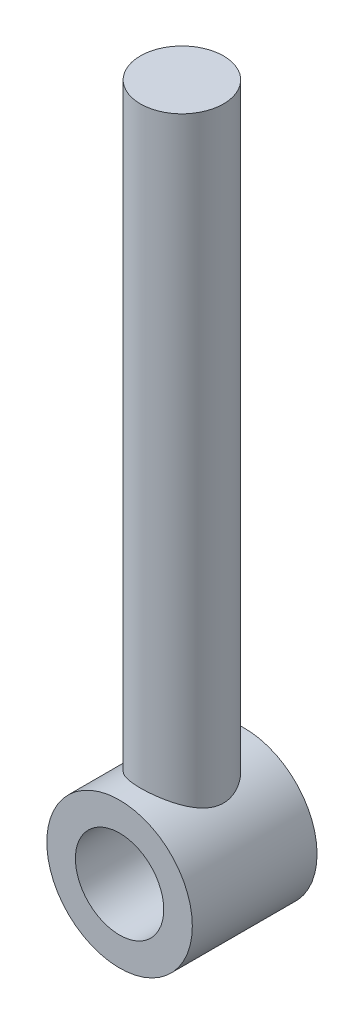
ISO-10303-21;
HEADER;
FILE_DESCRIPTION(('STEP AP214'),'2;1');
FILE_NAME('part.step','',(''),(''),'','','');
FILE_SCHEMA(('AUTOMOTIVE_DESIGN { 1 0 10303 214 1 1 1 1 }'));
ENDSEC;
DATA;
#1=APPLICATION_CONTEXT('core data for automotive mechanical design processes');
#2=APPLICATION_PROTOCOL_DEFINITION('international standard','automotive_design',2000,#1);
#3=PRODUCT_CONTEXT('',#1,'mechanical');
#4=PRODUCT('Part','Part','',(#3));
#5=PRODUCT_RELATED_PRODUCT_CATEGORY('part','',(#4));
#6=PRODUCT_DEFINITION_FORMATION('','',#4);
#7=PRODUCT_DEFINITION_CONTEXT('part definition',#1,'design');
#8=PRODUCT_DEFINITION('design','',#6,#7);
#9=PRODUCT_DEFINITION_SHAPE('','',#8);
#10=(LENGTH_UNIT() NAMED_UNIT(*) SI_UNIT(.MILLI.,.METRE.));
#11=(NAMED_UNIT(*) PLANE_ANGLE_UNIT() SI_UNIT($,.RADIAN.));
#12=(NAMED_UNIT(*) SI_UNIT($,.STERADIAN.) SOLID_ANGLE_UNIT());
#13=UNCERTAINTY_MEASURE_WITH_UNIT(LENGTH_MEASURE(1.E-05),#10,'distance_accuracy_value','');
#14=(GEOMETRIC_REPRESENTATION_CONTEXT(3) GLOBAL_UNCERTAINTY_ASSIGNED_CONTEXT((#13)) GLOBAL_UNIT_ASSIGNED_CONTEXT((#10,
#11,#12)) REPRESENTATION_CONTEXT('',''));
#15=CARTESIAN_POINT('',(0.,0.,0.));
#16=DIRECTION('',(0.,0.,1.));
#17=DIRECTION('',(1.,0.,0.));
#18=AXIS2_PLACEMENT_3D('',#15,#16,#17);
#19=CARTESIAN_POINT('',(0.,0.,-9.525));
#20=DIRECTION('',(0.,0.,1.));
#21=DIRECTION('',(1.,0.,0.));
#22=AXIS2_PLACEMENT_3D('',#19,#20,#21);
#23=CYLINDRICAL_SURFACE('',#22,11.1125);
#24=CARTESIAN_POINT('',(0.,0.,9.525));
#25=DIRECTION('',(0.,0.,1.));
#26=DIRECTION('',(1.,0.,0.));
#27=AXIS2_PLACEMENT_3D('',#24,#25,#26);
#28=CIRCLE('',#27,11.1125);
#29=CARTESIAN_POINT('',(11.1125,0.,9.525));
#30=VERTEX_POINT('',#29);
#31=EDGE_CURVE('E50',#30,#30,#28,.T.);
#32=ORIENTED_EDGE('',*,*,#31,.F.);
#33=EDGE_LOOP('',(#32));
#34=FACE_BOUND('',#33,.T.);
#35=CARTESIAN_POINT('',(0.,0.,-9.525));
#36=DIRECTION('',(0.,0.,1.));
#37=DIRECTION('',(1.,0.,0.));
#38=AXIS2_PLACEMENT_3D('',#35,#36,#37);
#39=CIRCLE('',#38,11.1125);
#40=CARTESIAN_POINT('',(11.1125,0.,-9.525));
#41=VERTEX_POINT('',#40);
#42=EDGE_CURVE('E10',#41,#41,#39,.T.);
#43=ORIENTED_EDGE('',*,*,#42,.T.);
#44=EDGE_LOOP('',(#43));
#45=FACE_BOUND('',#44,.T.);
#46=CARTESIAN_POINT('',(0.,11.1125,-6.35));
#47=CARTESIAN_POINT('',(0.163789182274866,11.1124987193566,-6.34999858739145));
#48=CARTESIAN_POINT('',(0.32762912857846,11.1088693064788,-6.34365291324172));
#49=CARTESIAN_POINT('',(0.65408591243348,11.0944381185428,-6.31834675529029));
#50=CARTESIAN_POINT('',(0.816701920974144,11.0836318593259,-6.2993783846984));
#51=CARTESIAN_POINT('',(1.13971905284884,11.0550908256635,-6.24902458450906));
#52=CARTESIAN_POINT('',(1.30011511022562,11.03734227173,-6.21761445817744));
#53=CARTESIAN_POINT('',(1.61726609325167,10.9953496184125,-6.14276122075287));
#54=CARTESIAN_POINT('',(1.77401943318414,10.9711027457359,-6.0993129718726));
#55=CARTESIAN_POINT('',(2.08199776129995,10.9168335923382,-6.00114702613865));
#56=CARTESIAN_POINT('',(2.23324736337085,10.8868421620341,-5.94648942156288));
#57=CARTESIAN_POINT('',(2.53024463011943,10.8216761904037,-5.82632434780674));
#58=CARTESIAN_POINT('',(2.67599018834381,10.7864996894518,-5.76081277535368));
#59=CARTESIAN_POINT('',(3.10359647441188,10.674359074649,-5.54898429796566));
#60=CARTESIAN_POINT('',(3.3762252005992,10.5907106620075,-5.38724499514674));
#61=CARTESIAN_POINT('',(3.9106715073846,10.4057691112419,-5.01427737869423));
#62=CARTESIAN_POINT('',(4.17028523550963,10.3036378350192,-4.80031797712822));
#63=CARTESIAN_POINT('',(4.53141063695516,10.1474768125783,-4.45161801935346));
#64=CARTESIAN_POINT('',(4.64716119796354,10.0948805006451,-4.33063660872074));
#65=CARTESIAN_POINT('',(4.86883414237915,9.98985145364251,-4.07982310988796));
#66=CARTESIAN_POINT('',(4.97475472030148,9.93741875032557,-3.94998940334246));
#67=CARTESIAN_POINT('',(5.18722276491486,9.82833425876501,-3.6673951957618));
#68=CARTESIAN_POINT('',(5.29258286171644,9.77184466338237,-3.51367757371605));
#69=CARTESIAN_POINT('',(5.48986923610043,9.66238677907193,-3.19666718342039));
#70=CARTESIAN_POINT('',(5.5817967101885,9.60941817674244,-3.03337526981464));
#71=CARTESIAN_POINT('',(5.75132663963913,9.50892223651364,-2.69814417853654));
#72=CARTESIAN_POINT('',(5.82894503852307,9.46138886525736,-2.52621490009034));
#73=CARTESIAN_POINT('',(5.96906489099455,9.37362073652479,-2.17452565013095));
#74=CARTESIAN_POINT('',(6.03157130399761,9.33338358567887,-1.9947682705423));
#75=CARTESIAN_POINT('',(6.12848290731384,9.2699472013044,-1.66922706046288));
#76=CARTESIAN_POINT('',(6.16604571819255,9.24494802025014,-1.52472718991916));
#77=CARTESIAN_POINT('',(6.23103019113533,9.20127473419396,-1.2325375603719));
#78=CARTESIAN_POINT('',(6.2584540118862,9.18259928288156,-1.08484848747521));
#79=CARTESIAN_POINT('',(6.30279529830521,9.15222116245191,-0.787320251147767));
#80=CARTESIAN_POINT('',(6.31972201465444,9.14051235427911,-0.637483100234715));
#81=CARTESIAN_POINT('',(6.34286840650351,9.12446585084189,-0.3365825166184));
#82=CARTESIAN_POINT('',(6.34908786840744,9.12012830262463,-0.185519059512307));
#83=CARTESIAN_POINT('',(6.3507267589001,9.11898717572708,0.11690073728876));
#84=CARTESIAN_POINT('',(6.34613149556416,9.12219384594957,0.268257195980187));
#85=CARTESIAN_POINT('',(6.32617972925881,9.13604137072775,0.56991236994911));
#86=CARTESIAN_POINT('',(6.31082318374093,9.14668225467717,0.72021108104206));
#87=CARTESIAN_POINT('',(6.26956140717988,9.17501386064166,1.0187321468202));
#88=CARTESIAN_POINT('',(6.24365203082823,9.19270735296751,1.16695366185752));
#89=CARTESIAN_POINT('',(6.18161229151501,9.23453963420613,1.46036560445911));
#90=CARTESIAN_POINT('',(6.14547779716499,9.2586810281273,1.60555478131379));
#91=CARTESIAN_POINT('',(6.06358276516132,9.31251885941885,1.89142114216922));
#92=CARTESIAN_POINT('',(6.01786492154382,9.34219059608329,2.03211525074053));
#93=CARTESIAN_POINT('',(5.91714143068887,9.40630930050389,2.30903936311048));
#94=CARTESIAN_POINT('',(5.86213273213709,9.440757836395,2.44526788270654));
#95=CARTESIAN_POINT('',(5.68384138406895,9.54992330536147,2.84640911066217));
#96=CARTESIAN_POINT('',(5.54725255369824,9.63048817261376,3.10391850530642));
#97=CARTESIAN_POINT('',(5.21723930061995,9.81371620700619,3.63536042653357));
#98=CARTESIAN_POINT('',(5.01821456576573,9.91785171069547,3.9053118106488));
#99=CARTESIAN_POINT('',(4.69016607811464,10.0749588662349,4.28401693842082));
#100=CARTESIAN_POINT('',(4.5758021583623,10.127517911557,4.40596239954848));
#101=CARTESIAN_POINT('',(4.33757365051825,10.2318130372492,4.64067961204268));
#102=CARTESIAN_POINT('',(4.21370745945029,10.2835489769812,4.75344980895617));
#103=CARTESIAN_POINT('',(3.94228596672726,10.3908469155461,4.98154578705665));
#104=CARTESIAN_POINT('',(3.79364125948817,10.4461703100015,5.09569033049433));
#105=CARTESIAN_POINT('',(3.48593050219194,10.5528406185058,5.31093424124828));
#106=CARTESIAN_POINT('',(3.32686871710476,10.6041891413932,5.41203889764341));
#107=CARTESIAN_POINT('',(2.9991532875134,10.7014925093249,5.60029262696502));
#108=CARTESIAN_POINT('',(2.83050170205788,10.7474485057677,5.68744468046912));
#109=CARTESIAN_POINT('',(2.48465393547033,10.8326290092148,5.84681388053217));
#110=CARTESIAN_POINT('',(2.30745881728341,10.8718543508605,5.9190328791073));
#111=CARTESIAN_POINT('',(1.95834408609265,10.9399248473026,6.04311997500992));
#112=CARTESIAN_POINT('',(1.78690503110866,10.9692997268987,6.09604895952073));
#113=CARTESIAN_POINT('',(1.43906988764796,11.0203276192939,6.18739867639159));
#114=CARTESIAN_POINT('',(1.2626739797921,11.0419809130641,6.2258199366584));
#115=CARTESIAN_POINT('',(0.906583181388643,11.0769012573418,6.28754585402102));
#116=CARTESIAN_POINT('',(0.726891124901375,11.0901751939431,6.3108629240423));
#117=CARTESIAN_POINT('',(0.36574676229455,11.1079501199315,6.34204750991667));
#118=CARTESIAN_POINT('',(0.184294655501192,11.1124520913529,6.34991675517699));
#119=CARTESIAN_POINT('',(-0.156551233178845,11.1125414018011,6.35007193014569));
#120=CARTESIAN_POINT('',(-0.315947453758254,11.1091450566475,6.34413444822674));
#121=CARTESIAN_POINT('',(-0.633554741466046,11.0955632409524,6.32032154409347));
#122=CARTESIAN_POINT('',(-0.791765828213249,11.0853778830491,6.30244631994128));
#123=CARTESIAN_POINT('',(-1.10584248293699,11.0584634211064,6.25498505354365));
#124=CARTESIAN_POINT('',(-1.26170815931692,11.0417346204714,6.22539955427616));
#125=CARTESIAN_POINT('',(-1.57004719056988,11.0021258998364,6.15487352989566));
#126=CARTESIAN_POINT('',(-1.72252044266781,10.9792457937537,6.11393266127093));
#127=CARTESIAN_POINT('',(-2.02154850851585,10.9281177035519,6.02163286080456));
#128=CARTESIAN_POINT('',(-2.16814875191669,10.8999288122875,5.97038823269051));
#129=CARTESIAN_POINT('',(-2.45633694201106,10.83862581059,5.85771948093256));
#130=CARTESIAN_POINT('',(-2.59792323667482,10.8055100951865,5.79629203937064));
#131=CARTESIAN_POINT('',(-3.01405600421984,10.6997583210323,5.59752940502375));
#132=CARTESIAN_POINT('',(-3.28018372388134,10.6206807757402,5.44564912644511));
#133=CARTESIAN_POINT('',(-3.81165777450684,10.4424911716952,5.08985399901586));
#134=CARTESIAN_POINT('',(-4.07403940401031,10.3421505076206,4.8821684731709));
#135=CARTESIAN_POINT('',(-4.56240375851503,10.1361910862346,4.42921431728148));
#136=CARTESIAN_POINT('',(-4.78834422290964,10.0305663843328,4.18390268631277));
#137=CARTESIAN_POINT('',(-5.10833813702033,9.86959991824147,3.77646573222037));
#138=CARTESIAN_POINT('',(-5.2164228072678,9.81274585454842,3.62573725812408));
#139=CARTESIAN_POINT('',(-5.41949435046242,9.70206624310502,3.31452687263568));
#140=CARTESIAN_POINT('',(-5.51447803383915,9.6482414347396,3.15404259974702));
#141=CARTESIAN_POINT('',(-5.69042781328816,9.54552604341733,2.8242585787943));
#142=CARTESIAN_POINT('',(-5.77140670823898,9.49663097243614,2.65496706567376));
#143=CARTESIAN_POINT('',(-5.91854271955343,9.40563628246293,2.30840703123968));
#144=CARTESIAN_POINT('',(-5.98471054905824,9.36353175793383,2.13114438778607));
#145=CARTESIAN_POINT('',(-6.08892448962093,9.29600151375372,1.80826777478347));
#146=CARTESIAN_POINT('',(-6.12995855713197,9.26893347358905,1.66395572933249));
#147=CARTESIAN_POINT('',(-6.20185955716913,9.22097964131551,1.37187397782483));
#148=CARTESIAN_POINT('',(-6.23273179853649,9.20009062168179,1.22410612054405));
#149=CARTESIAN_POINT('',(-6.28392783384962,9.16519882994749,0.926064026821193));
#150=CARTESIAN_POINT('',(-6.3042598354546,9.15119070016199,0.775791834905704));
#151=CARTESIAN_POINT('',(-6.33412830023861,9.13054254202809,0.473666180206462));
#152=CARTESIAN_POINT('',(-6.34366459657401,9.12390262755277,0.321812693020976));
#153=CARTESIAN_POINT('',(-6.35180552534443,9.1182371424447,0.0173605259340344));
#154=CARTESIAN_POINT('',(-6.35038798008045,9.11922701946156,-0.135239040311896));
#155=CARTESIAN_POINT('',(-6.33659153338375,9.12881878912142,-0.439696456049032));
#156=CARTESIAN_POINT('',(-6.32421259143351,9.13742070990145,-0.591554302796472));
#157=CARTESIAN_POINT('',(-6.28866704495837,9.16192059731151,-0.893459931467987));
#158=CARTESIAN_POINT('',(-6.26549670286389,9.1778210917534,-1.04350706777128));
#159=CARTESIAN_POINT('',(-6.20868929729764,9.21634397852355,-1.34075039767382));
#160=CARTESIAN_POINT('',(-6.17504800064379,9.23896908930269,-1.48794541261005));
#161=CARTESIAN_POINT('',(-6.06037275506286,9.31493041309819,-1.91871624118717));
#162=CARTESIAN_POINT('',(-5.96490248818097,9.37685596082907,-2.19708116362456));
#163=CARTESIAN_POINT('',(-5.73855530904389,9.51705047954382,-2.7343563309575));
#164=CARTESIAN_POINT('',(-5.60766534030091,9.59532547486451,-2.99325935670708));
#165=CARTESIAN_POINT('',(-5.2909324026657,9.77402820471517,-3.52690413279016));
#166=CARTESIAN_POINT('',(-5.09973106283505,9.87601111861115,-3.79794579547108));
#167=CARTESIAN_POINT('',(-4.67796200608109,10.082629694807,-4.30678851603772));
#168=CARTESIAN_POINT('',(-4.44736013661926,10.1872675908832,-4.54456040754791));
#169=CARTESIAN_POINT('',(-4.05929674975724,10.3456578690081,-4.88664866298802));
#170=CARTESIAN_POINT('',(-3.91392736004757,10.4016593644488,-5.00386838687986));
#171=CARTESIAN_POINT('',(-3.6125755533397,10.510116718042,-5.22558682415199));
#172=CARTESIAN_POINT('',(-3.45659702207595,10.5625738604758,-5.33009015637635));
#173=CARTESIAN_POINT('',(-3.13482962335295,10.6624990435905,-5.52546578452876));
#174=CARTESIAN_POINT('',(-2.96904170657644,10.7099675665128,-5.61633939838183));
#175=CARTESIAN_POINT('',(-2.62865577869677,10.7985518590141,-5.78347563854189));
#176=CARTESIAN_POINT('',(-2.45406021162774,10.8396693782086,-5.85974229026302));
#177=CARTESIAN_POINT('',(-2.12903892499702,10.9076722964642,-5.98451167377467));
#178=CARTESIAN_POINT('',(-1.97983507324833,10.9357883269308,-6.03553982175865));
#179=CARTESIAN_POINT('',(-1.67715731482965,10.9862789040347,-6.12654908918597));
#180=CARTESIAN_POINT('',(-1.523684168648,11.0086544660528,-6.16653216239099));
#181=CARTESIAN_POINT('',(-1.21380914115612,11.047110213145,-6.23492462810363));
#182=CARTESIAN_POINT('',(-1.05741540134478,11.0632057629575,-6.26336227477038));
#183=CARTESIAN_POINT('',(-0.742464625139814,11.0887931743215,-6.30844872896127));
#184=CARTESIAN_POINT('',(-0.583908871933025,11.0982887927644,-6.32510424334691));
#185=CARTESIAN_POINT('',(-0.354192616818319,11.107079573332,-6.34051035114624));
#186=CARTESIAN_POINT('',(-0.283423431225954,11.1091108804494,-6.34406748266149));
#187=CARTESIAN_POINT('',(-0.141772674344398,11.1118214418446,-6.34881273704929));
#188=CARTESIAN_POINT('',(-0.0708910920459385,11.1125005542869,-6.35000061140401));
#189=CARTESIAN_POINT('',(0.,11.1125,-6.35));
#190=B_SPLINE_CURVE_WITH_KNOTS('',3,(#46,#47,#48,#49,#50,#51,#52,#53,#54,#55,#56,#57,#58,#59,
#60,#61,#62,#63,#64,#65,#66,#67,#68,#69,#70,#71,#72,#73,#74,#75,#76,#77,#78,#79,#80,#81,#82,#83,
#84,#85,#86,#87,#88,#89,#90,#91,#92,#93,#94,#95,#96,#97,#98,#99,#100,#101,#102,#103,#104,#105,
#106,#107,#108,#109,#110,#111,#112,#113,#114,#115,#116,#117,#118,#119,#120,#121,#122,#123,#124,
#125,#126,#127,#128,#129,#130,#131,#132,#133,#134,#135,#136,#137,#138,#139,#140,#141,#142,#143,
#144,#145,#146,#147,#148,#149,#150,#151,#152,#153,#154,#155,#156,#157,#158,#159,#160,#161,#162,
#163,#164,#165,#166,#167,#168,#169,#170,#171,#172,#173,#174,#175,#176,#177,#178,#179,#180,#181,
#182,#183,#184,#185,#186,#187,#188,#189),.UNSPECIFIED.,.T.,.F.,(4,2,2,2,2,2,2,2,2,2,2,2,2,2,2,2,
2,2,2,2,2,2,2,2,2,2,2,2,2,2,2,2,2,2,2,2,2,2,2,2,2,2,2,2,2,2,2,2,2,2,2,2,2,2,2,2,2,2,2,2,2,2,2,2,
2,2,2,2,2,2,2,4),(0.,0.491293664424857,0.982894582745444,1.47547625270744,1.96826847781411,
2.45848488633429,2.94888704265496,3.92843091582512,4.97873918957367,5.50484008094094,
6.03103741144496,6.61452599359135,7.19796256999419,7.78074508526672,8.36333608395564,
8.81701344462746,9.27059415740204,9.72377457736605,10.1769640375902,10.6307695160569,
11.0845767888113,11.5385624959824,11.9927318955029,12.4449193993586,12.8972557010125,
13.8014842249754,14.8506166284301,15.3759631901706,15.9013985704393,16.4868924798895,
17.0721481565992,17.6572786427371,18.2423365166751,18.7869966745896,19.3316370115115,
19.8758291823437,20.4199604265681,20.8980042696717,21.3760401816247,21.8540539307714,
22.3320821419075,22.8050740902663,23.2782204600314,24.2238591846606,25.267928522267,
26.3132000877309,26.894589949686,27.4761211080957,28.0571179681152,28.6376932136011,
29.0945945135835,29.5512567344273,30.0075628173247,30.4638759521678,30.9211132032522,
31.3783521444679,31.835749566942,32.2933321460827,33.1916958118015,34.0903910864646,
35.1274728752759,36.1654582141277,36.7497093733108,37.3337476834758,37.9177294836226,
38.5015501166653,38.9815704441667,39.4615058064901,39.9402594788386,40.4187404056471,
40.6313594030559,40.8440007014774),.UNSPECIFIED.);
#191=CARTESIAN_POINT('',(0.,11.1125,-6.35));
#192=VERTEX_POINT('',#191);
#193=EDGE_CURVE('E41',#192,#192,#190,.T.);
#194=ORIENTED_EDGE('',*,*,#193,.T.);
#195=EDGE_LOOP('',(#194));
#196=FACE_BOUND('',#195,.T.);
#197=ADVANCED_FACE('F37',(#34,#45,#196),#23,.T.);
#198=CARTESIAN_POINT('',(0.,0.,-9.525));
#199=DIRECTION('',(0.,0.,1.));
#200=DIRECTION('',(1.,0.,0.));
#201=AXIS2_PLACEMENT_3D('',#198,#199,#200);
#202=PLANE('',#201);
#203=CARTESIAN_POINT('',(0.,0.,-9.525));
#204=DIRECTION('',(0.,0.,1.));
#205=DIRECTION('',(1.,0.,0.));
#206=AXIS2_PLACEMENT_3D('',#203,#204,#205);
#207=CIRCLE('',#206,6.74623999999999);
#208=CARTESIAN_POINT('',(6.74623999999999,0.,-9.525));
#209=VERTEX_POINT('',#208);
#210=EDGE_CURVE('E61',#209,#209,#207,.T.);
#211=ORIENTED_EDGE('',*,*,#210,.T.);
#212=EDGE_LOOP('',(#211));
#213=FACE_BOUND('',#212,.T.);
#214=ORIENTED_EDGE('',*,*,#42,.F.);
#215=EDGE_LOOP('',(#214));
#216=FACE_BOUND('',#215,.T.);
#217=ADVANCED_FACE('F77',(#213,#216),#202,.F.);
#218=CARTESIAN_POINT('',(0.,0.,9.525));
#219=DIRECTION('',(0.,0.,1.));
#220=DIRECTION('',(1.,0.,0.));
#221=AXIS2_PLACEMENT_3D('',#218,#219,#220);
#222=PLANE('',#221);
#223=CARTESIAN_POINT('',(0.,0.,9.525));
#224=DIRECTION('',(0.,0.,1.));
#225=DIRECTION('',(1.,0.,0.));
#226=AXIS2_PLACEMENT_3D('',#223,#224,#225);
#227=CIRCLE('',#226,6.74623999999999);
#228=CARTESIAN_POINT('',(6.74623999999999,0.,9.525));
#229=VERTEX_POINT('',#228);
#230=EDGE_CURVE('E65',#229,#229,#227,.T.);
#231=ORIENTED_EDGE('',*,*,#230,.F.);
#232=EDGE_LOOP('',(#231));
#233=FACE_BOUND('',#232,.T.);
#234=ORIENTED_EDGE('',*,*,#31,.T.);
#235=EDGE_LOOP('',(#234));
#236=FACE_BOUND('',#235,.T.);
#237=ADVANCED_FACE('F73',(#233,#236),#222,.T.);
#238=CARTESIAN_POINT('',(0.,101.6,0.));
#239=DIRECTION('',(0.,-1.,0.));
#240=DIRECTION('',(0.,0.,-1.));
#241=AXIS2_PLACEMENT_3D('',#238,#239,#240);
#242=CYLINDRICAL_SURFACE('',#241,6.35);
#243=ORIENTED_EDGE('',*,*,#193,.F.);
#244=EDGE_LOOP('',(#243));
#245=FACE_BOUND('',#244,.T.);
#246=CARTESIAN_POINT('',(0.,101.6,0.));
#247=DIRECTION('',(0.,1.,0.));
#248=DIRECTION('',(0.,0.,1.));
#249=AXIS2_PLACEMENT_3D('',#246,#247,#248);
#250=CIRCLE('',#249,6.35);
#251=CARTESIAN_POINT('',(0.,101.6,6.35));
#252=VERTEX_POINT('',#251);
#253=EDGE_CURVE('E57',#252,#252,#250,.T.);
#254=ORIENTED_EDGE('',*,*,#253,.F.);
#255=EDGE_LOOP('',(#254));
#256=FACE_BOUND('',#255,.T.);
#257=ADVANCED_FACE('F76',(#245,#256),#242,.T.);
#258=CARTESIAN_POINT('',(0.,101.6,0.));
#259=DIRECTION('',(0.,1.,0.));
#260=DIRECTION('',(0.,0.,1.));
#261=AXIS2_PLACEMENT_3D('',#258,#259,#260);
#262=PLANE('',#261);
#263=ORIENTED_EDGE('',*,*,#253,.T.);
#264=EDGE_LOOP('',(#263));
#265=FACE_BOUND('',#264,.T.);
#266=ADVANCED_FACE('F89',(#265),#262,.T.);
#267=CARTESIAN_POINT('',(0.,0.,9.525));
#268=DIRECTION('',(0.,0.,1.));
#269=DIRECTION('',(1.,0.,0.));
#270=AXIS2_PLACEMENT_3D('',#267,#268,#269);
#271=CYLINDRICAL_SURFACE('',#270,6.74623999999999);
#272=ORIENTED_EDGE('',*,*,#230,.T.);
#273=EDGE_LOOP('',(#272));
#274=FACE_BOUND('',#273,.T.);
#275=ORIENTED_EDGE('',*,*,#210,.F.);
#276=EDGE_LOOP('',(#275));
#277=FACE_BOUND('',#276,.T.);
#278=ADVANCED_FACE('F70',(#274,#277),#271,.F.);
#279=CLOSED_SHELL('',(#197,#217,#237,#257,#266,#278));
#280=MANIFOLD_SOLID_BREP('B2',#279);
#281=ADVANCED_BREP_SHAPE_REPRESENTATION('',(#18,#280),#14);
#282=SHAPE_DEFINITION_REPRESENTATION(#9,#281);
ENDSEC;
END-ISO-10303-21;
